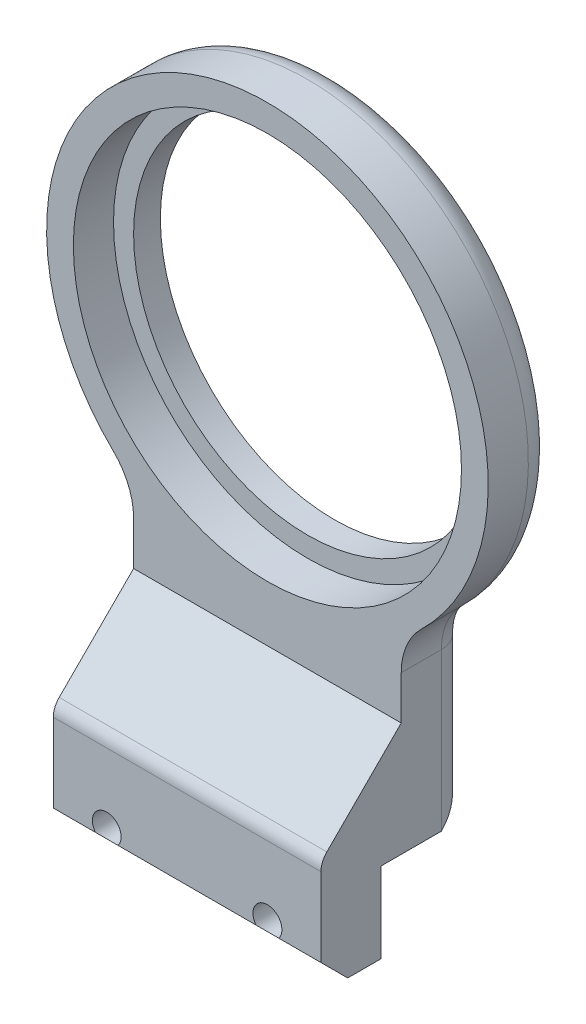
ISO-10303-21;
HEADER;
FILE_DESCRIPTION(('STEP AP214'),'2;1');
FILE_NAME('part.step','',(''),(''),'','','');
FILE_SCHEMA(('AUTOMOTIVE_DESIGN { 1 0 10303 214 1 1 1 1 }'));
ENDSEC;
DATA;
#1=APPLICATION_CONTEXT('core data for automotive mechanical design processes');
#2=APPLICATION_PROTOCOL_DEFINITION('international standard','automotive_design',2000,#1);
#3=PRODUCT_CONTEXT('',#1,'mechanical');
#4=PRODUCT('Part','Part','',(#3));
#5=PRODUCT_RELATED_PRODUCT_CATEGORY('part','',(#4));
#6=PRODUCT_DEFINITION_FORMATION('','',#4);
#7=PRODUCT_DEFINITION_CONTEXT('part definition',#1,'design');
#8=PRODUCT_DEFINITION('design','',#6,#7);
#9=PRODUCT_DEFINITION_SHAPE('','',#8);
#10=(LENGTH_UNIT() NAMED_UNIT(*) SI_UNIT(.MILLI.,.METRE.));
#11=(NAMED_UNIT(*) PLANE_ANGLE_UNIT() SI_UNIT($,.RADIAN.));
#12=(NAMED_UNIT(*) SI_UNIT($,.STERADIAN.) SOLID_ANGLE_UNIT());
#13=UNCERTAINTY_MEASURE_WITH_UNIT(LENGTH_MEASURE(1.E-05),#10,'distance_accuracy_value','');
#14=(GEOMETRIC_REPRESENTATION_CONTEXT(3) GLOBAL_UNCERTAINTY_ASSIGNED_CONTEXT((#13)) GLOBAL_UNIT_ASSIGNED_CONTEXT((#10,
#11,#12)) REPRESENTATION_CONTEXT('',''));
#15=CARTESIAN_POINT('',(0.,0.,0.));
#16=DIRECTION('',(0.,0.,1.));
#17=DIRECTION('',(1.,0.,0.));
#18=AXIS2_PLACEMENT_3D('',#15,#16,#17);
#19=CARTESIAN_POINT('',(-12.012999621604,-33.8335683625686,22.));
#20=DIRECTION('',(0.,0.,-1.));
#21=DIRECTION('',(-1.,0.,0.));
#22=AXIS2_PLACEMENT_3D('',#19,#20,#21);
#23=CYLINDRICAL_SURFACE('',#22,1.7);
#24=CARTESIAN_POINT('',(-12.012999621604,-33.8335683625686,16.));
#25=DIRECTION('',(0.,0.,1.));
#26=DIRECTION('',(1.,0.,0.));
#27=AXIS2_PLACEMENT_3D('',#24,#25,#26);
#28=CIRCLE('',#27,1.7);
#29=CARTESIAN_POINT('',(-10.312999621604,-33.8335683625686,16.));
#30=VERTEX_POINT('',#29);
#31=EDGE_CURVE('E231',#30,#30,#28,.F.);
#32=ORIENTED_EDGE('',*,*,#31,.F.);
#33=EDGE_LOOP('',(#32));
#34=FACE_BOUND('',#33,.T.);
#35=CARTESIAN_POINT('',(-12.012999621604,-33.8335683625686,13.));
#36=DIRECTION('',(0.,0.,-1.));
#37=DIRECTION('',(-1.,0.,0.));
#38=AXIS2_PLACEMENT_3D('',#35,#36,#37);
#39=CIRCLE('',#38,1.7);
#40=CARTESIAN_POINT('',(-13.712999621604,-33.8335683625686,13.));
#41=VERTEX_POINT('',#40);
#42=EDGE_CURVE('E325',#41,#41,#39,.F.);
#43=ORIENTED_EDGE('',*,*,#42,.F.);
#44=EDGE_LOOP('',(#43));
#45=FACE_BOUND('',#44,.T.);
#46=ADVANCED_FACE('F44',(#34,#45),#23,.F.);
#47=CARTESIAN_POINT('',(12.,-33.8335683625686,22.));
#48=DIRECTION('',(0.,0.,-1.));
#49=DIRECTION('',(-1.,0.,0.));
#50=AXIS2_PLACEMENT_3D('',#47,#48,#49);
#51=CYLINDRICAL_SURFACE('',#50,1.7);
#52=CARTESIAN_POINT('',(12.,-33.8335683625686,16.));
#53=DIRECTION('',(0.,0.,1.));
#54=DIRECTION('',(1.,0.,0.));
#55=AXIS2_PLACEMENT_3D('',#52,#53,#54);
#56=CIRCLE('',#55,1.7);
#57=CARTESIAN_POINT('',(13.7,-33.8335683625686,16.));
#58=VERTEX_POINT('',#57);
#59=EDGE_CURVE('E228',#58,#58,#56,.F.);
#60=ORIENTED_EDGE('',*,*,#59,.F.);
#61=EDGE_LOOP('',(#60));
#62=FACE_BOUND('',#61,.T.);
#63=CARTESIAN_POINT('',(12.,-33.8335683625686,13.));
#64=DIRECTION('',(0.,0.,-1.));
#65=DIRECTION('',(-1.,0.,0.));
#66=AXIS2_PLACEMENT_3D('',#63,#64,#65);
#67=CIRCLE('',#66,1.7);
#68=CARTESIAN_POINT('',(10.3,-33.8335683625686,13.));
#69=VERTEX_POINT('',#68);
#70=EDGE_CURVE('E335',#69,#69,#67,.F.);
#71=ORIENTED_EDGE('',*,*,#70,.F.);
#72=EDGE_LOOP('',(#71));
#73=FACE_BOUND('',#72,.T.);
#74=ADVANCED_FACE('F397',(#62,#73),#51,.F.);
#75=CARTESIAN_POINT('',(20.,-39.1580037476248,8.));
#76=DIRECTION('',(0.,1.,0.));
#77=DIRECTION('',(0.,0.,1.));
#78=AXIS2_PLACEMENT_3D('',#75,#76,#77);
#79=PLANE('',#78);
#80=DIRECTION('',(0.,0.,1.));
#81=VECTOR('',#80,1.);
#82=CARTESIAN_POINT('',(20.,-39.1580037476248,8.));
#83=LINE('',#82,#81);
#84=CARTESIAN_POINT('',(20.,-39.1580037476248,13.));
#85=VERTEX_POINT('',#84);
#86=CARTESIAN_POINT('',(20.,-39.1580037476248,18.));
#87=VERTEX_POINT('',#86);
#88=EDGE_CURVE('E179',#85,#87,#83,.T.);
#89=ORIENTED_EDGE('',*,*,#88,.T.);
#90=DIRECTION('',(-1.,0.,0.));
#91=VECTOR('',#90,1.);
#92=CARTESIAN_POINT('',(-20.,-39.1580037476248,18.));
#93=LINE('',#92,#91);
#94=CARTESIAN_POINT('',(-20.,-39.1580037476248,18.));
#95=VERTEX_POINT('',#94);
#96=EDGE_CURVE('E247',#87,#95,#93,.T.);
#97=ORIENTED_EDGE('',*,*,#96,.T.);
#98=DIRECTION('',(0.,0.,1.));
#99=VECTOR('',#98,1.);
#100=CARTESIAN_POINT('',(-20.,-39.1580037476248,8.));
#101=LINE('',#100,#99);
#102=CARTESIAN_POINT('',(-20.,-39.1580037476248,13.));
#103=VERTEX_POINT('',#102);
#104=EDGE_CURVE('E182',#103,#95,#101,.T.);
#105=ORIENTED_EDGE('',*,*,#104,.F.);
#106=DIRECTION('',(-1.,0.,0.));
#107=VECTOR('',#106,1.);
#108=CARTESIAN_POINT('',(20.,-39.1580037476248,13.));
#109=LINE('',#108,#107);
#110=EDGE_CURVE('E166',#85,#103,#109,.T.);
#111=ORIENTED_EDGE('',*,*,#110,.F.);
#112=EDGE_LOOP('',(#89,#97,#105,#111));
#113=FACE_BOUND('',#112,.T.);
#114=ADVANCED_FACE('F178',(#113),#79,.F.);
#115=CARTESIAN_POINT('',(20.,-27.1580037476248,10.));
#116=DIRECTION('',(0.,1.,0.));
#117=DIRECTION('',(-1.,0.,0.));
#118=AXIS2_PLACEMENT_3D('',#115,#116,#117);
#119=PLANE('',#118);
#120=DIRECTION('',(0.,0.,-1.));
#121=VECTOR('',#120,1.);
#122=CARTESIAN_POINT('',(-20.,-27.1580037476248,10.));
#123=LINE('',#122,#121);
#124=CARTESIAN_POINT('',(-20.,-27.1580037476248,13.));
#125=VERTEX_POINT('',#124);
#126=CARTESIAN_POINT('',(-20.,-27.1580037476248,3.99999999999998));
#127=VERTEX_POINT('',#126);
#128=EDGE_CURVE('E215',#125,#127,#123,.T.);
#129=ORIENTED_EDGE('',*,*,#128,.T.);
#130=DIRECTION('',(1.,0.,0.));
#131=VECTOR('',#130,1.);
#132=CARTESIAN_POINT('',(20.,-27.1580037476248,3.99999999999998));
#133=LINE('',#132,#131);
#134=CARTESIAN_POINT('',(20.,-27.1580037476248,3.99999999999998));
#135=VERTEX_POINT('',#134);
#136=EDGE_CURVE('E252',#127,#135,#133,.T.);
#137=ORIENTED_EDGE('',*,*,#136,.T.);
#138=DIRECTION('',(0.,0.,-1.));
#139=VECTOR('',#138,1.);
#140=CARTESIAN_POINT('',(20.,-27.1580037476248,10.));
#141=LINE('',#140,#139);
#142=CARTESIAN_POINT('',(20.,-27.1580037476248,13.));
#143=VERTEX_POINT('',#142);
#144=EDGE_CURVE('E213',#143,#135,#141,.T.);
#145=ORIENTED_EDGE('',*,*,#144,.F.);
#146=DIRECTION('',(1.,0.,0.));
#147=VECTOR('',#146,1.);
#148=CARTESIAN_POINT('',(20.,-27.1580037476248,13.));
#149=LINE('',#148,#147);
#150=EDGE_CURVE('E169',#125,#143,#149,.T.);
#151=ORIENTED_EDGE('',*,*,#150,.F.);
#152=EDGE_LOOP('',(#129,#137,#145,#151));
#153=FACE_BOUND('',#152,.T.);
#154=ADVANCED_FACE('F340',(#153),#119,.F.);
#155=CARTESIAN_POINT('',(0.,27.1580037476248,10.));
#156=DIRECTION('',(0.,0.,-1.));
#157=DIRECTION('',(-1.,0.,0.));
#158=AXIS2_PLACEMENT_3D('',#155,#156,#157);
#159=CYLINDRICAL_SURFACE('',#158,26.);
#160=CARTESIAN_POINT('',(0.,27.1580037476248,0.));
#161=DIRECTION('',(0.,0.,1.));
#162=DIRECTION('',(1.,0.,0.));
#163=AXIS2_PLACEMENT_3D('',#160,#161,#162);
#164=CIRCLE('',#163,26.);
#165=CARTESIAN_POINT('',(26.,27.1580037476248,0.));
#166=VERTEX_POINT('',#165);
#167=EDGE_CURVE('E201',#166,#166,#164,.T.);
#168=ORIENTED_EDGE('',*,*,#167,.F.);
#169=EDGE_LOOP('',(#168));
#170=FACE_BOUND('',#169,.T.);
#171=CARTESIAN_POINT('',(0.,27.1580037476248,4.));
#172=DIRECTION('',(0.,0.,1.));
#173=DIRECTION('',(1.,0.,0.));
#174=AXIS2_PLACEMENT_3D('',#171,#172,#173);
#175=CIRCLE('',#174,26.);
#176=CARTESIAN_POINT('',(26.,27.1580037476248,4.));
#177=VERTEX_POINT('',#176);
#178=EDGE_CURVE('E199',#177,#177,#175,.T.);
#179=ORIENTED_EDGE('',*,*,#178,.T.);
#180=EDGE_LOOP('',(#179));
#181=FACE_BOUND('',#180,.T.);
#182=ADVANCED_FACE('F422',(#170,#181),#159,.F.);
#183=CARTESIAN_POINT('',(0.,27.1580037476248,10.));
#184=DIRECTION('',(0.,0.,1.));
#185=DIRECTION('',(1.,0.,0.));
#186=AXIS2_PLACEMENT_3D('',#183,#184,#185);
#187=PLANE('',#186);
#188=CARTESIAN_POINT('',(0.,27.1580037476248,10.));
#189=DIRECTION('',(0.,0.,1.));
#190=DIRECTION('',(1.,0.,0.));
#191=AXIS2_PLACEMENT_3D('',#188,#189,#190);
#192=CIRCLE('',#191,33.);
#193=CARTESIAN_POINT('',(23.0232558139535,3.51630982089325,10.));
#194=VERTEX_POINT('',#193);
#195=CARTESIAN_POINT('',(-23.0232558139535,3.51630982089323,10.));
#196=VERTEX_POINT('',#195);
#197=EDGE_CURVE('E207',#194,#196,#192,.T.);
#198=ORIENTED_EDGE('',*,*,#197,.T.);
#199=CARTESIAN_POINT('',(-30.,-3.64783985387392,10.));
#200=DIRECTION('',(0.,0.,1.));
#201=DIRECTION('',(1.,0.,0.));
#202=AXIS2_PLACEMENT_3D('',#199,#200,#201);
#203=CIRCLE('',#202,10.);
#204=CARTESIAN_POINT('',(-20.,-3.64783985387392,10.));
#205=VERTEX_POINT('',#204);
#206=EDGE_CURVE('E268',#196,#205,#203,.F.);
#207=ORIENTED_EDGE('',*,*,#206,.T.);
#208=DIRECTION('',(0.,-1.,0.));
#209=VECTOR('',#208,1.);
#210=CARTESIAN_POINT('',(-20.,-27.1580037476248,10.));
#211=LINE('',#210,#209);
#212=CARTESIAN_POINT('',(-20.,-10.1580037476247,10.));
#213=VERTEX_POINT('',#212);
#214=EDGE_CURVE('E210',#205,#213,#211,.T.);
#215=ORIENTED_EDGE('',*,*,#214,.T.);
#216=DIRECTION('',(1.,0.,0.));
#217=VECTOR('',#216,1.);
#218=CARTESIAN_POINT('',(20.,-10.1580037476247,10.));
#219=LINE('',#218,#217);
#220=CARTESIAN_POINT('',(20.,-10.1580037476247,10.));
#221=VERTEX_POINT('',#220);
#222=EDGE_CURVE('E218',#213,#221,#219,.T.);
#223=ORIENTED_EDGE('',*,*,#222,.T.);
#224=DIRECTION('',(0.,1.,0.));
#225=VECTOR('',#224,1.);
#226=CARTESIAN_POINT('',(20.,-27.1580037476248,10.));
#227=LINE('',#226,#225);
#228=CARTESIAN_POINT('',(20.,-3.6478398538739,10.));
#229=VERTEX_POINT('',#228);
#230=EDGE_CURVE('E204',#221,#229,#227,.T.);
#231=ORIENTED_EDGE('',*,*,#230,.T.);
#232=CARTESIAN_POINT('',(30.,-3.6478398538739,10.));
#233=DIRECTION('',(0.,0.,1.));
#234=DIRECTION('',(1.,0.,0.));
#235=AXIS2_PLACEMENT_3D('',#232,#233,#234);
#236=CIRCLE('',#235,10.);
#237=EDGE_CURVE('E270',#229,#194,#236,.F.);
#238=ORIENTED_EDGE('',*,*,#237,.T.);
#239=EDGE_LOOP('',(#198,#207,#215,#223,#231,#238));
#240=FACE_BOUND('',#239,.T.);
#241=CARTESIAN_POINT('',(0.,27.1580037476248,10.));
#242=DIRECTION('',(0.,0.,1.));
#243=DIRECTION('',(1.,0.,0.));
#244=AXIS2_PLACEMENT_3D('',#241,#242,#243);
#245=CIRCLE('',#244,29.);
#246=CARTESIAN_POINT('',(29.,27.1580037476248,10.));
#247=VERTEX_POINT('',#246);
#248=EDGE_CURVE('E189',#247,#247,#245,.T.);
#249=ORIENTED_EDGE('',*,*,#248,.F.);
#250=EDGE_LOOP('',(#249));
#251=FACE_BOUND('',#250,.T.);
#252=ADVANCED_FACE('F365',(#240,#251),#187,.T.);
#253=CARTESIAN_POINT('',(0.,27.1580037476248,0.));
#254=DIRECTION('',(0.,0.,1.));
#255=DIRECTION('',(1.,0.,0.));
#256=AXIS2_PLACEMENT_3D('',#253,#254,#255);
#257=PLANE('',#256);
#258=DIRECTION('',(-1.,0.,0.));
#259=VECTOR('',#258,1.);
#260=CARTESIAN_POINT('',(0.,-23.1580037476248,0.));
#261=LINE('',#260,#259);
#262=CARTESIAN_POINT('',(16.,-23.1580037476248,0.));
#263=VERTEX_POINT('',#262);
#264=CARTESIAN_POINT('',(-16.,-23.1580037476248,0.));
#265=VERTEX_POINT('',#264);
#266=EDGE_CURVE('E255',#263,#265,#261,.T.);
#267=ORIENTED_EDGE('',*,*,#266,.T.);
#268=DIRECTION('',(0.,-1.,0.));
#269=VECTOR('',#268,1.);
#270=CARTESIAN_POINT('',(-16.,27.1580037476248,0.));
#271=LINE('',#270,#269);
#272=CARTESIAN_POINT('',(-16.,-3.64783985387392,0.));
#273=VERTEX_POINT('',#272);
#274=EDGE_CURVE('E283',#265,#273,#271,.F.);
#275=ORIENTED_EDGE('',*,*,#274,.T.);
#276=CARTESIAN_POINT('',(-30.,-3.64783985387392,0.));
#277=DIRECTION('',(0.,0.,1.));
#278=DIRECTION('',(1.,0.,0.));
#279=AXIS2_PLACEMENT_3D('',#276,#277,#278);
#280=CIRCLE('',#279,14.);
#281=CARTESIAN_POINT('',(-20.2325581395349,6.38196969080009,0.));
#282=VERTEX_POINT('',#281);
#283=EDGE_CURVE('E281',#273,#282,#280,.T.);
#284=ORIENTED_EDGE('',*,*,#283,.T.);
#285=CARTESIAN_POINT('',(0.,27.1580037476248,0.));
#286=DIRECTION('',(0.,0.,1.));
#287=DIRECTION('',(1.,0.,0.));
#288=AXIS2_PLACEMENT_3D('',#285,#286,#287);
#289=CIRCLE('',#288,29.);
#290=CARTESIAN_POINT('',(20.2325581395349,6.3819696908001,0.));
#291=VERTEX_POINT('',#290);
#292=EDGE_CURVE('E279',#282,#291,#289,.F.);
#293=ORIENTED_EDGE('',*,*,#292,.T.);
#294=CARTESIAN_POINT('',(30.,-3.6478398538739,0.));
#295=DIRECTION('',(0.,0.,1.));
#296=DIRECTION('',(1.,0.,0.));
#297=AXIS2_PLACEMENT_3D('',#294,#295,#296);
#298=CIRCLE('',#297,14.);
#299=CARTESIAN_POINT('',(16.,-3.6478398538739,0.));
#300=VERTEX_POINT('',#299);
#301=EDGE_CURVE('E277',#291,#300,#298,.T.);
#302=ORIENTED_EDGE('',*,*,#301,.T.);
#303=DIRECTION('',(0.,1.,0.));
#304=VECTOR('',#303,1.);
#305=CARTESIAN_POINT('',(16.,27.1580037476248,0.));
#306=LINE('',#305,#304);
#307=EDGE_CURVE('E275',#300,#263,#306,.F.);
#308=ORIENTED_EDGE('',*,*,#307,.T.);
#309=EDGE_LOOP('',(#267,#275,#284,#293,#302,#308));
#310=FACE_BOUND('',#309,.T.);
#311=ORIENTED_EDGE('',*,*,#167,.T.);
#312=EDGE_LOOP('',(#311));
#313=FACE_BOUND('',#312,.T.);
#314=ADVANCED_FACE('F384',(#310,#313),#257,.F.);
#315=CARTESIAN_POINT('',(20.,-27.1580037476248,10.));
#316=DIRECTION('',(-1.,0.,0.));
#317=DIRECTION('',(0.,0.,1.));
#318=AXIS2_PLACEMENT_3D('',#315,#316,#317);
#319=PLANE('',#318);
#320=DIRECTION('',(0.,0.707106781186544,-0.707106781186551));
#321=VECTOR('',#320,1.);
#322=CARTESIAN_POINT('',(20.,-18.6580037476247,18.5));
#323=LINE('',#322,#321);
#324=CARTESIAN_POINT('',(20.,-21.2793240911843,21.1213203435596));
#325=VERTEX_POINT('',#324);
#326=EDGE_CURVE('E225',#221,#325,#323,.F.);
#327=ORIENTED_EDGE('',*,*,#326,.T.);
#328=CARTESIAN_POINT('',(20.,-23.4006444347439,19.));
#329=DIRECTION('',(-1.,0.,0.));
#330=DIRECTION('',(0.,0.,1.));
#331=AXIS2_PLACEMENT_3D('',#328,#329,#330);
#332=CIRCLE('',#331,3.);
#333=CARTESIAN_POINT('',(20.,-23.4006444347439,22.));
#334=VERTEX_POINT('',#333);
#335=EDGE_CURVE('E11',#325,#334,#332,.F.);
#336=ORIENTED_EDGE('',*,*,#335,.T.);
#337=DIRECTION('',(0.,1.,0.));
#338=VECTOR('',#337,1.);
#339=CARTESIAN_POINT('',(20.,-27.1580037476248,22.));
#340=LINE('',#339,#338);
#341=CARTESIAN_POINT('',(20.,-35.1580037476249,22.));
#342=VERTEX_POINT('',#341);
#343=EDGE_CURVE('E194',#342,#334,#340,.T.);
#344=ORIENTED_EDGE('',*,*,#343,.F.);
#345=DIRECTION('',(0.,-0.707106781186546,-0.707106781186549));
#346=VECTOR('',#345,1.);
#347=CARTESIAN_POINT('',(20.,-35.1580037476249,22.));
#348=LINE('',#347,#346);
#349=EDGE_CURVE('E188',#342,#87,#348,.T.);
#350=ORIENTED_EDGE('',*,*,#349,.T.);
#351=ORIENTED_EDGE('',*,*,#88,.F.);
#352=DIRECTION('',(0.,-1.,0.));
#353=VECTOR('',#352,1.);
#354=CARTESIAN_POINT('',(20.,-27.1580037476248,13.));
#355=LINE('',#354,#353);
#356=EDGE_CURVE('E161',#143,#85,#355,.T.);
#357=ORIENTED_EDGE('',*,*,#356,.F.);
#358=ORIENTED_EDGE('',*,*,#144,.T.);
#359=DIRECTION('',(0.,1.,0.));
#360=VECTOR('',#359,1.);
#361=CARTESIAN_POINT('',(20.,-27.1580037476248,4.));
#362=LINE('',#361,#360);
#363=CARTESIAN_POINT('',(20.,-3.6478398538739,4.));
#364=VERTEX_POINT('',#363);
#365=EDGE_CURVE('E295',#135,#364,#362,.T.);
#366=ORIENTED_EDGE('',*,*,#365,.T.);
#367=DIRECTION('',(0.,0.,1.));
#368=VECTOR('',#367,1.);
#369=CARTESIAN_POINT('',(20.,-3.6478398538739,10.));
#370=LINE('',#369,#368);
#371=EDGE_CURVE('E266',#364,#229,#370,.T.);
#372=ORIENTED_EDGE('',*,*,#371,.T.);
#373=ORIENTED_EDGE('',*,*,#230,.F.);
#374=EDGE_LOOP('',(#327,#336,#344,#350,#351,#357,#358,#366,#372,#373));
#375=FACE_BOUND('',#374,.T.);
#376=ADVANCED_FACE('F185',(#375),#319,.F.);
#377=CARTESIAN_POINT('',(0.,27.1580037476248,10.));
#378=DIRECTION('',(0.,0.,-1.));
#379=DIRECTION('',(-1.,0.,0.));
#380=AXIS2_PLACEMENT_3D('',#377,#378,#379);
#381=CYLINDRICAL_SURFACE('',#380,33.);
#382=DIRECTION('',(0.,0.,-1.));
#383=VECTOR('',#382,1.);
#384=CARTESIAN_POINT('',(23.0232558139535,3.51630982089324,10.));
#385=LINE('',#384,#383);
#386=CARTESIAN_POINT('',(23.0232558139535,3.51630982089324,4.));
#387=VERTEX_POINT('',#386);
#388=EDGE_CURVE('E261',#194,#387,#385,.T.);
#389=ORIENTED_EDGE('',*,*,#388,.T.);
#390=CARTESIAN_POINT('',(0.,27.1580037476248,4.));
#391=DIRECTION('',(0.,0.,1.));
#392=DIRECTION('',(1.,0.,0.));
#393=AXIS2_PLACEMENT_3D('',#390,#391,#392);
#394=CIRCLE('',#393,33.);
#395=CARTESIAN_POINT('',(-23.0232558139535,3.51630982089323,4.));
#396=VERTEX_POINT('',#395);
#397=EDGE_CURVE('E272',#387,#396,#394,.T.);
#398=ORIENTED_EDGE('',*,*,#397,.T.);
#399=DIRECTION('',(0.,0.,-1.));
#400=VECTOR('',#399,1.);
#401=CARTESIAN_POINT('',(-23.0232558139535,3.51630982089323,10.));
#402=LINE('',#401,#400);
#403=EDGE_CURVE('E264',#396,#196,#402,.F.);
#404=ORIENTED_EDGE('',*,*,#403,.T.);
#405=ORIENTED_EDGE('',*,*,#197,.F.);
#406=EDGE_LOOP('',(#389,#398,#404,#405));
#407=FACE_BOUND('',#406,.T.);
#408=ADVANCED_FACE('F361',(#407),#381,.T.);
#409=CARTESIAN_POINT('',(-20.,-27.1580037476248,10.));
#410=DIRECTION('',(1.,0.,0.));
#411=DIRECTION('',(0.,0.,-1.));
#412=AXIS2_PLACEMENT_3D('',#409,#410,#411);
#413=PLANE('',#412);
#414=DIRECTION('',(0.,-1.,0.));
#415=VECTOR('',#414,1.);
#416=CARTESIAN_POINT('',(-20.,-27.1580037476248,22.));
#417=LINE('',#416,#415);
#418=CARTESIAN_POINT('',(-20.,-23.4006444347439,22.));
#419=VERTEX_POINT('',#418);
#420=CARTESIAN_POINT('',(-20.,-35.1580037476249,22.));
#421=VERTEX_POINT('',#420);
#422=EDGE_CURVE('E235',#419,#421,#417,.T.);
#423=ORIENTED_EDGE('',*,*,#422,.F.);
#424=CARTESIAN_POINT('',(-20.,-23.4006444347439,19.));
#425=DIRECTION('',(1.,0.,0.));
#426=DIRECTION('',(0.,0.,-1.));
#427=AXIS2_PLACEMENT_3D('',#424,#425,#426);
#428=CIRCLE('',#427,3.);
#429=CARTESIAN_POINT('',(-20.,-21.2793240911843,21.1213203435596));
#430=VERTEX_POINT('',#429);
#431=EDGE_CURVE('E66',#419,#430,#428,.F.);
#432=ORIENTED_EDGE('',*,*,#431,.T.);
#433=DIRECTION('',(0.,-0.707106781186544,0.707106781186551));
#434=VECTOR('',#433,1.);
#435=CARTESIAN_POINT('',(-20.,-18.6580037476247,18.5));
#436=LINE('',#435,#434);
#437=EDGE_CURVE('E223',#430,#213,#436,.F.);
#438=ORIENTED_EDGE('',*,*,#437,.T.);
#439=ORIENTED_EDGE('',*,*,#214,.F.);
#440=DIRECTION('',(0.,0.,1.));
#441=VECTOR('',#440,1.);
#442=CARTESIAN_POINT('',(-20.,-3.64783985387392,0.));
#443=LINE('',#442,#441);
#444=CARTESIAN_POINT('',(-20.,-3.64783985387392,4.));
#445=VERTEX_POINT('',#444);
#446=EDGE_CURVE('E258',#205,#445,#443,.F.);
#447=ORIENTED_EDGE('',*,*,#446,.T.);
#448=DIRECTION('',(0.,-1.,0.));
#449=VECTOR('',#448,1.);
#450=CARTESIAN_POINT('',(-20.,-27.1580037476248,4.));
#451=LINE('',#450,#449);
#452=EDGE_CURVE('E285',#445,#127,#451,.T.);
#453=ORIENTED_EDGE('',*,*,#452,.T.);
#454=ORIENTED_EDGE('',*,*,#128,.F.);
#455=DIRECTION('',(0.,1.,0.));
#456=VECTOR('',#455,1.);
#457=CARTESIAN_POINT('',(-20.,-27.1580037476248,13.));
#458=LINE('',#457,#456);
#459=EDGE_CURVE('E183',#103,#125,#458,.T.);
#460=ORIENTED_EDGE('',*,*,#459,.F.);
#461=ORIENTED_EDGE('',*,*,#104,.T.);
#462=DIRECTION('',(0.,0.707106781186546,0.707106781186549));
#463=VECTOR('',#462,1.);
#464=CARTESIAN_POINT('',(-20.,-35.1580037476249,22.));
#465=LINE('',#464,#463);
#466=EDGE_CURVE('E249',#95,#421,#465,.T.);
#467=ORIENTED_EDGE('',*,*,#466,.T.);
#468=EDGE_LOOP('',(#423,#432,#438,#439,#447,#453,#454,#460,#461,#467));
#469=FACE_BOUND('',#468,.T.);
#470=ADVANCED_FACE('F316',(#469),#413,.F.);
#471=CARTESIAN_POINT('',(0.,27.1580037476248,4.));
#472=DIRECTION('',(0.,0.,1.));
#473=DIRECTION('',(1.,0.,0.));
#474=AXIS2_PLACEMENT_3D('',#471,#472,#473);
#475=CYLINDRICAL_SURFACE('',#474,29.);
#476=CARTESIAN_POINT('',(0.,27.1580037476248,4.));
#477=DIRECTION('',(0.,0.,1.));
#478=DIRECTION('',(1.,0.,0.));
#479=AXIS2_PLACEMENT_3D('',#476,#477,#478);
#480=CIRCLE('',#479,29.);
#481=CARTESIAN_POINT('',(29.,27.1580037476248,4.));
#482=VERTEX_POINT('',#481);
#483=EDGE_CURVE('E192',#482,#482,#480,.T.);
#484=ORIENTED_EDGE('',*,*,#483,.F.);
#485=EDGE_LOOP('',(#484));
#486=FACE_BOUND('',#485,.T.);
#487=ORIENTED_EDGE('',*,*,#248,.T.);
#488=EDGE_LOOP('',(#487));
#489=FACE_BOUND('',#488,.T.);
#490=ADVANCED_FACE('F417',(#486,#489),#475,.F.);
#491=CARTESIAN_POINT('',(0.,27.1580037476248,4.));
#492=DIRECTION('',(0.,0.,1.));
#493=DIRECTION('',(1.,0.,0.));
#494=AXIS2_PLACEMENT_3D('',#491,#492,#493);
#495=PLANE('',#494);
#496=ORIENTED_EDGE('',*,*,#178,.F.);
#497=EDGE_LOOP('',(#496));
#498=FACE_BOUND('',#497,.T.);
#499=ORIENTED_EDGE('',*,*,#483,.T.);
#500=EDGE_LOOP('',(#499));
#501=FACE_BOUND('',#500,.T.);
#502=ADVANCED_FACE('F412',(#498,#501),#495,.T.);
#503=CARTESIAN_POINT('',(0.,0.,22.));
#504=DIRECTION('',(0.,0.,1.));
#505=DIRECTION('',(1.,0.,0.));
#506=AXIS2_PLACEMENT_3D('',#503,#504,#505);
#507=PLANE('',#506);
#508=ORIENTED_EDGE('',*,*,#343,.T.);
#509=DIRECTION('',(1.,0.,0.));
#510=VECTOR('',#509,1.);
#511=CARTESIAN_POINT('',(-20.,-23.4006444347439,22.));
#512=LINE('',#511,#510);
#513=EDGE_CURVE('E297',#334,#419,#512,.F.);
#514=ORIENTED_EDGE('',*,*,#513,.T.);
#515=ORIENTED_EDGE('',*,*,#422,.T.);
#516=DIRECTION('',(1.,0.,0.));
#517=VECTOR('',#516,1.);
#518=CARTESIAN_POINT('',(20.,-35.1580037476249,22.));
#519=LINE('',#518,#517);
#520=CARTESIAN_POINT('',(-13.7066261774926,-35.1580037476249,22.));
#521=VERTEX_POINT('',#520);
#522=EDGE_CURVE('E239',#421,#521,#519,.T.);
#523=ORIENTED_EDGE('',*,*,#522,.T.);
#524=CARTESIAN_POINT('',(-12.012999621604,-33.8335683625686,22.));
#525=DIRECTION('',(0.,0.,1.));
#526=DIRECTION('',(1.,0.,0.));
#527=AXIS2_PLACEMENT_3D('',#524,#525,#526);
#528=CIRCLE('',#527,2.15);
#529=CARTESIAN_POINT('',(-10.3193730657155,-35.1580037476249,22.));
#530=VERTEX_POINT('',#529);
#531=EDGE_CURVE('E328',#530,#521,#528,.T.);
#532=ORIENTED_EDGE('',*,*,#531,.F.);
#533=DIRECTION('',(1.,0.,0.));
#534=VECTOR('',#533,1.);
#535=CARTESIAN_POINT('',(20.,-35.1580037476249,22.));
#536=LINE('',#535,#534);
#537=CARTESIAN_POINT('',(10.2873716366909,-35.1580037476249,22.));
#538=VERTEX_POINT('',#537);
#539=EDGE_CURVE('E237',#530,#538,#536,.T.);
#540=ORIENTED_EDGE('',*,*,#539,.T.);
#541=CARTESIAN_POINT('',(12.,-33.8335683625686,22.));
#542=DIRECTION('',(0.,0.,1.));
#543=DIRECTION('',(1.,0.,0.));
#544=AXIS2_PLACEMENT_3D('',#541,#542,#543);
#545=CIRCLE('',#544,2.165);
#546=CARTESIAN_POINT('',(13.7126283633091,-35.1580037476249,22.));
#547=VERTEX_POINT('',#546);
#548=EDGE_CURVE('E324',#547,#538,#545,.T.);
#549=ORIENTED_EDGE('',*,*,#548,.F.);
#550=DIRECTION('',(1.,0.,0.));
#551=VECTOR('',#550,1.);
#552=CARTESIAN_POINT('',(20.,-35.1580037476249,22.));
#553=LINE('',#552,#551);
#554=EDGE_CURVE('E227',#547,#342,#553,.T.);
#555=ORIENTED_EDGE('',*,*,#554,.T.);
#556=EDGE_LOOP('',(#508,#514,#515,#523,#532,#540,#549,#555));
#557=FACE_BOUND('',#556,.T.);
#558=ADVANCED_FACE('F313',(#557),#507,.T.);
#559=CARTESIAN_POINT('',(0.,-24.1580037476248,24.0000000000002));
#560=DIRECTION('',(0.,0.707106781186551,0.707106781186544));
#561=DIRECTION('',(1.,0.,0.));
#562=AXIS2_PLACEMENT_3D('',#559,#560,#561);
#563=PLANE('',#562);
#564=ORIENTED_EDGE('',*,*,#437,.F.);
#565=DIRECTION('',(-1.,0.,0.));
#566=VECTOR('',#565,1.);
#567=CARTESIAN_POINT('',(20.,-21.2793240911843,21.1213203435596));
#568=LINE('',#567,#566);
#569=EDGE_CURVE('E52',#430,#325,#568,.F.);
#570=ORIENTED_EDGE('',*,*,#569,.T.);
#571=ORIENTED_EDGE('',*,*,#326,.F.);
#572=ORIENTED_EDGE('',*,*,#222,.F.);
#573=EDGE_LOOP('',(#564,#570,#571,#572));
#574=FACE_BOUND('',#573,.T.);
#575=ADVANCED_FACE('F411',(#574),#563,.T.);
#576=CARTESIAN_POINT('',(12.,-33.8335683625686,16.));
#577=DIRECTION('',(0.,0.,1.));
#578=DIRECTION('',(1.,0.,0.));
#579=AXIS2_PLACEMENT_3D('',#576,#577,#578);
#580=PLANE('',#579);
#581=CARTESIAN_POINT('',(12.,-33.8335683625686,16.));
#582=DIRECTION('',(0.,0.,1.));
#583=DIRECTION('',(1.,0.,0.));
#584=AXIS2_PLACEMENT_3D('',#581,#582,#583);
#585=CIRCLE('',#584,2.165);
#586=CARTESIAN_POINT('',(14.165,-33.8335683625686,16.));
#587=VERTEX_POINT('',#586);
#588=EDGE_CURVE('E321',#587,#587,#585,.T.);
#589=ORIENTED_EDGE('',*,*,#588,.T.);
#590=EDGE_LOOP('',(#589));
#591=FACE_BOUND('',#590,.T.);
#592=ORIENTED_EDGE('',*,*,#59,.T.);
#593=EDGE_LOOP('',(#592));
#594=FACE_BOUND('',#593,.T.);
#595=ADVANCED_FACE('F444',(#591,#594),#580,.T.);
#596=CARTESIAN_POINT('',(12.,-33.8335683625686,16.));
#597=DIRECTION('',(0.,0.,1.));
#598=DIRECTION('',(1.,0.,0.));
#599=AXIS2_PLACEMENT_3D('',#596,#597,#598);
#600=CYLINDRICAL_SURFACE('',#599,2.165);
#601=ORIENTED_EDGE('',*,*,#588,.F.);
#602=EDGE_LOOP('',(#601));
#603=FACE_BOUND('',#602,.T.);
#604=ORIENTED_EDGE('',*,*,#548,.T.);
#605=CARTESIAN_POINT('',(12.,-33.8335683625686,23.3244353850563));
#606=DIRECTION('',(0.,-0.707106781186549,0.707106781186546));
#607=DIRECTION('',(0.,0.707106781186546,0.707106781186549));
#608=AXIS2_PLACEMENT_3D('',#605,#606,#607);
#609=ELLIPSE('',#608,3.06177236253776,2.165);
#610=EDGE_CURVE('E244',#538,#547,#609,.T.);
#611=ORIENTED_EDGE('',*,*,#610,.T.);
#612=EDGE_LOOP('',(#604,#611));
#613=FACE_BOUND('',#612,.T.);
#614=ADVANCED_FACE('F613',(#603,#613),#600,.F.);
#615=CARTESIAN_POINT('',(-12.012999621604,-33.8335683625686,16.));
#616=DIRECTION('',(0.,0.,1.));
#617=DIRECTION('',(1.,0.,0.));
#618=AXIS2_PLACEMENT_3D('',#615,#616,#617);
#619=PLANE('',#618);
#620=CARTESIAN_POINT('',(-12.012999621604,-33.8335683625686,16.));
#621=DIRECTION('',(0.,0.,1.));
#622=DIRECTION('',(1.,0.,0.));
#623=AXIS2_PLACEMENT_3D('',#620,#621,#622);
#624=CIRCLE('',#623,2.15);
#625=CARTESIAN_POINT('',(-9.86299962160403,-33.8335683625686,16.));
#626=VERTEX_POINT('',#625);
#627=EDGE_CURVE('E232',#626,#626,#624,.T.);
#628=ORIENTED_EDGE('',*,*,#627,.T.);
#629=EDGE_LOOP('',(#628));
#630=FACE_BOUND('',#629,.T.);
#631=ORIENTED_EDGE('',*,*,#31,.T.);
#632=EDGE_LOOP('',(#631));
#633=FACE_BOUND('',#632,.T.);
#634=ADVANCED_FACE('F603',(#630,#633),#619,.T.);
#635=CARTESIAN_POINT('',(-12.012999621604,-33.8335683625686,16.));
#636=DIRECTION('',(0.,0.,1.));
#637=DIRECTION('',(1.,0.,0.));
#638=AXIS2_PLACEMENT_3D('',#635,#636,#637);
#639=CYLINDRICAL_SURFACE('',#638,2.15);
#640=ORIENTED_EDGE('',*,*,#627,.F.);
#641=EDGE_LOOP('',(#640));
#642=FACE_BOUND('',#641,.T.);
#643=ORIENTED_EDGE('',*,*,#531,.T.);
#644=CARTESIAN_POINT('',(-12.012999621604,-33.8335683625686,23.3244353850563));
#645=DIRECTION('',(0.,-0.707106781186549,0.707106781186546));
#646=DIRECTION('',(0.,0.707106781186546,0.707106781186549));
#647=AXIS2_PLACEMENT_3D('',#644,#645,#646);
#648=ELLIPSE('',#647,3.04055915910216,2.15);
#649=EDGE_CURVE('E242',#521,#530,#648,.T.);
#650=ORIENTED_EDGE('',*,*,#649,.T.);
#651=EDGE_LOOP('',(#643,#650));
#652=FACE_BOUND('',#651,.T.);
#653=ADVANCED_FACE('F573',(#642,#652),#639,.F.);
#654=CARTESIAN_POINT('',(0.,0.,13.));
#655=DIRECTION('',(0.,0.,-1.));
#656=DIRECTION('',(-1.,0.,0.));
#657=AXIS2_PLACEMENT_3D('',#654,#655,#656);
#658=PLANE('',#657);
#659=ORIENTED_EDGE('',*,*,#356,.T.);
#660=ORIENTED_EDGE('',*,*,#110,.T.);
#661=ORIENTED_EDGE('',*,*,#459,.T.);
#662=ORIENTED_EDGE('',*,*,#150,.T.);
#663=EDGE_LOOP('',(#659,#660,#661,#662));
#664=FACE_BOUND('',#663,.T.);
#665=ORIENTED_EDGE('',*,*,#70,.T.);
#666=EDGE_LOOP('',(#665));
#667=FACE_BOUND('',#666,.T.);
#668=ORIENTED_EDGE('',*,*,#42,.T.);
#669=EDGE_LOOP('',(#668));
#670=FACE_BOUND('',#669,.T.);
#671=ADVANCED_FACE('F163',(#664,#667,#670),#658,.T.);
#672=CARTESIAN_POINT('',(0.,-35.1580037476249,22.));
#673=DIRECTION('',(0.,-0.707106781186549,0.707106781186546));
#674=DIRECTION('',(-1.,0.,0.));
#675=AXIS2_PLACEMENT_3D('',#672,#673,#674);
#676=PLANE('',#675);
#677=ORIENTED_EDGE('',*,*,#466,.F.);
#678=ORIENTED_EDGE('',*,*,#96,.F.);
#679=ORIENTED_EDGE('',*,*,#349,.F.);
#680=ORIENTED_EDGE('',*,*,#554,.F.);
#681=ORIENTED_EDGE('',*,*,#610,.F.);
#682=ORIENTED_EDGE('',*,*,#539,.F.);
#683=ORIENTED_EDGE('',*,*,#649,.F.);
#684=ORIENTED_EDGE('',*,*,#522,.F.);
#685=EDGE_LOOP('',(#677,#678,#679,#680,#681,#682,#683,#684));
#686=FACE_BOUND('',#685,.T.);
#687=ADVANCED_FACE('F445',(#686),#676,.T.);
#688=CARTESIAN_POINT('',(20.,-27.1580037476248,3.99999999999998));
#689=DIRECTION('',(0.,0.707106781186546,0.707106781186549));
#690=DIRECTION('',(1.,0.,0.));
#691=AXIS2_PLACEMENT_3D('',#688,#689,#690);
#692=PLANE('',#691);
#693=ORIENTED_EDGE('',*,*,#136,.F.);
#694=CARTESIAN_POINT('',(-16.,-27.1580037476249,4.));
#695=DIRECTION('',(0.,0.707106781186546,0.707106781186549));
#696=DIRECTION('',(0.,-0.707106781186549,0.707106781186546));
#697=AXIS2_PLACEMENT_3D('',#694,#695,#696);
#698=ELLIPSE('',#697,5.65685424949239,4.);
#699=EDGE_CURVE('E289',#127,#265,#698,.F.);
#700=ORIENTED_EDGE('',*,*,#699,.T.);
#701=ORIENTED_EDGE('',*,*,#266,.F.);
#702=CARTESIAN_POINT('',(16.,-27.1580037476249,4.));
#703=DIRECTION('',(0.,0.707106781186546,0.707106781186549));
#704=DIRECTION('',(0.,0.707106781186549,-0.707106781186546));
#705=AXIS2_PLACEMENT_3D('',#702,#703,#704);
#706=ELLIPSE('',#705,5.65685424949239,4.);
#707=EDGE_CURVE('E287',#263,#135,#706,.F.);
#708=ORIENTED_EDGE('',*,*,#707,.T.);
#709=EDGE_LOOP('',(#693,#700,#701,#708));
#710=FACE_BOUND('',#709,.T.);
#711=ADVANCED_FACE('F451',(#710),#692,.F.);
#712=CARTESIAN_POINT('',(-30.,-3.64783985387392,10.));
#713=DIRECTION('',(0.,0.,-1.));
#714=DIRECTION('',(-1.,0.,0.));
#715=AXIS2_PLACEMENT_3D('',#712,#713,#714);
#716=CYLINDRICAL_SURFACE('',#715,10.);
#717=ORIENTED_EDGE('',*,*,#403,.F.);
#718=CARTESIAN_POINT('',(-30.,-3.64783985387392,4.));
#719=DIRECTION('',(0.,0.,1.));
#720=DIRECTION('',(1.,0.,0.));
#721=AXIS2_PLACEMENT_3D('',#718,#719,#720);
#722=CIRCLE('',#721,10.);
#723=EDGE_CURVE('E291',#396,#445,#722,.F.);
#724=ORIENTED_EDGE('',*,*,#723,.T.);
#725=ORIENTED_EDGE('',*,*,#446,.F.);
#726=ORIENTED_EDGE('',*,*,#206,.F.);
#727=EDGE_LOOP('',(#717,#724,#725,#726));
#728=FACE_BOUND('',#727,.T.);
#729=ADVANCED_FACE('F370',(#728),#716,.F.);
#730=CARTESIAN_POINT('',(30.,-3.6478398538739,10.));
#731=DIRECTION('',(0.,0.,-1.));
#732=DIRECTION('',(-1.,0.,0.));
#733=AXIS2_PLACEMENT_3D('',#730,#731,#732);
#734=CYLINDRICAL_SURFACE('',#733,10.);
#735=ORIENTED_EDGE('',*,*,#371,.F.);
#736=CARTESIAN_POINT('',(30.,-3.6478398538739,4.));
#737=DIRECTION('',(0.,0.,1.));
#738=DIRECTION('',(1.,0.,0.));
#739=AXIS2_PLACEMENT_3D('',#736,#737,#738);
#740=CIRCLE('',#739,10.);
#741=EDGE_CURVE('E293',#364,#387,#740,.F.);
#742=ORIENTED_EDGE('',*,*,#741,.T.);
#743=ORIENTED_EDGE('',*,*,#388,.F.);
#744=ORIENTED_EDGE('',*,*,#237,.F.);
#745=EDGE_LOOP('',(#735,#742,#743,#744));
#746=FACE_BOUND('',#745,.T.);
#747=ADVANCED_FACE('F357',(#746),#734,.F.);
#748=CARTESIAN_POINT('',(16.,-27.1580037476248,4.));
#749=DIRECTION('',(0.,1.,0.));
#750=DIRECTION('',(0.,0.,1.));
#751=AXIS2_PLACEMENT_3D('',#748,#749,#750);
#752=CYLINDRICAL_SURFACE('',#751,4.);
#753=ORIENTED_EDGE('',*,*,#707,.F.);
#754=ORIENTED_EDGE('',*,*,#307,.F.);
#755=CARTESIAN_POINT('',(16.,-3.6478398538739,4.));
#756=DIRECTION('',(0.,1.,0.));
#757=DIRECTION('',(0.,0.,1.));
#758=AXIS2_PLACEMENT_3D('',#755,#756,#757);
#759=CIRCLE('',#758,4.);
#760=EDGE_CURVE('E173',#364,#300,#759,.T.);
#761=ORIENTED_EDGE('',*,*,#760,.F.);
#762=ORIENTED_EDGE('',*,*,#365,.F.);
#763=EDGE_LOOP('',(#753,#754,#761,#762));
#764=FACE_BOUND('',#763,.T.);
#765=ADVANCED_FACE('F347',(#764),#752,.T.);
#766=CARTESIAN_POINT('',(-16.,-27.1580037476248,4.));
#767=DIRECTION('',(0.,-1.,0.));
#768=DIRECTION('',(0.,0.,-1.));
#769=AXIS2_PLACEMENT_3D('',#766,#767,#768);
#770=CYLINDRICAL_SURFACE('',#769,4.);
#771=ORIENTED_EDGE('',*,*,#699,.F.);
#772=ORIENTED_EDGE('',*,*,#452,.F.);
#773=CARTESIAN_POINT('',(-16.,-3.64783985387392,4.));
#774=DIRECTION('',(0.,1.,0.));
#775=DIRECTION('',(0.,0.,1.));
#776=AXIS2_PLACEMENT_3D('',#773,#774,#775);
#777=CIRCLE('',#776,4.);
#778=EDGE_CURVE('E303',#273,#445,#777,.T.);
#779=ORIENTED_EDGE('',*,*,#778,.F.);
#780=ORIENTED_EDGE('',*,*,#274,.F.);
#781=EDGE_LOOP('',(#771,#772,#779,#780));
#782=FACE_BOUND('',#781,.T.);
#783=ADVANCED_FACE('F376',(#782),#770,.T.);
#784=CARTESIAN_POINT('',(30.,-3.6478398538739,4.));
#785=DIRECTION('',(0.,0.,1.));
#786=DIRECTION('',(1.,0.,0.));
#787=AXIS2_PLACEMENT_3D('',#784,#785,#786);
#788=TOROIDAL_SURFACE('',#787,14.,4.);
#789=ORIENTED_EDGE('',*,*,#760,.T.);
#790=ORIENTED_EDGE('',*,*,#301,.F.);
#791=CARTESIAN_POINT('',(20.2325581395349,6.3819696908001,4.));
#792=DIRECTION('',(0.716414967476714,0.697674418604652,0.));
#793=DIRECTION('',(-0.697674418604652,0.716414967476714,0.));
#794=AXIS2_PLACEMENT_3D('',#791,#792,#793);
#795=CIRCLE('',#794,4.);
#796=EDGE_CURVE('E300',#387,#291,#795,.T.);
#797=ORIENTED_EDGE('',*,*,#796,.F.);
#798=ORIENTED_EDGE('',*,*,#741,.F.);
#799=EDGE_LOOP('',(#789,#790,#797,#798));
#800=FACE_BOUND('',#799,.T.);
#801=ADVANCED_FACE('F353',(#800),#788,.T.);
#802=CARTESIAN_POINT('',(-30.,-3.64783985387392,4.));
#803=DIRECTION('',(0.,0.,1.));
#804=DIRECTION('',(1.,0.,0.));
#805=AXIS2_PLACEMENT_3D('',#802,#803,#804);
#806=TOROIDAL_SURFACE('',#805,14.,4.);
#807=ORIENTED_EDGE('',*,*,#778,.T.);
#808=ORIENTED_EDGE('',*,*,#723,.F.);
#809=CARTESIAN_POINT('',(-20.2325581395349,6.38196969080009,4.));
#810=DIRECTION('',(-0.716414967476715,0.697674418604651,0.));
#811=DIRECTION('',(-0.697674418604651,-0.716414967476715,0.));
#812=AXIS2_PLACEMENT_3D('',#809,#810,#811);
#813=CIRCLE('',#812,4.);
#814=EDGE_CURVE('E298',#282,#396,#813,.T.);
#815=ORIENTED_EDGE('',*,*,#814,.F.);
#816=ORIENTED_EDGE('',*,*,#283,.F.);
#817=EDGE_LOOP('',(#807,#808,#815,#816));
#818=FACE_BOUND('',#817,.T.);
#819=ADVANCED_FACE('F380',(#818),#806,.T.);
#820=CARTESIAN_POINT('',(0.,27.1580037476248,4.));
#821=DIRECTION('',(0.,0.,1.));
#822=DIRECTION('',(1.,0.,0.));
#823=AXIS2_PLACEMENT_3D('',#820,#821,#822);
#824=TOROIDAL_SURFACE('',#823,29.,4.);
#825=ORIENTED_EDGE('',*,*,#796,.T.);
#826=ORIENTED_EDGE('',*,*,#292,.F.);
#827=ORIENTED_EDGE('',*,*,#814,.T.);
#828=ORIENTED_EDGE('',*,*,#397,.F.);
#829=EDGE_LOOP('',(#825,#826,#827,#828));
#830=FACE_BOUND('',#829,.T.);
#831=ADVANCED_FACE('F387',(#830),#824,.T.);
#832=CARTESIAN_POINT('',(0.,-23.4006444347439,19.));
#833=DIRECTION('',(-1.,0.,0.));
#834=DIRECTION('',(0.,0.,1.));
#835=AXIS2_PLACEMENT_3D('',#832,#833,#834);
#836=CYLINDRICAL_SURFACE('',#835,3.);
#837=ORIENTED_EDGE('',*,*,#335,.F.);
#838=ORIENTED_EDGE('',*,*,#569,.F.);
#839=ORIENTED_EDGE('',*,*,#431,.F.);
#840=ORIENTED_EDGE('',*,*,#513,.F.);
#841=EDGE_LOOP('',(#837,#838,#839,#840));
#842=FACE_BOUND('',#841,.T.);
#843=ADVANCED_FACE('F46',(#842),#836,.T.);
#844=CLOSED_SHELL('',(#46,#74,#114,#154,#182,#252,#314,#376,#408,#470,#490,#502,#558,#575,#595,
#614,#634,#653,#671,#687,#711,#729,#747,#765,#783,#801,#819,#831,#843));
#845=MANIFOLD_SOLID_BREP('B2',#844);
#846=ADVANCED_BREP_SHAPE_REPRESENTATION('',(#18,#845),#14);
#847=SHAPE_DEFINITION_REPRESENTATION(#9,#846);
ENDSEC;
END-ISO-10303-21;
